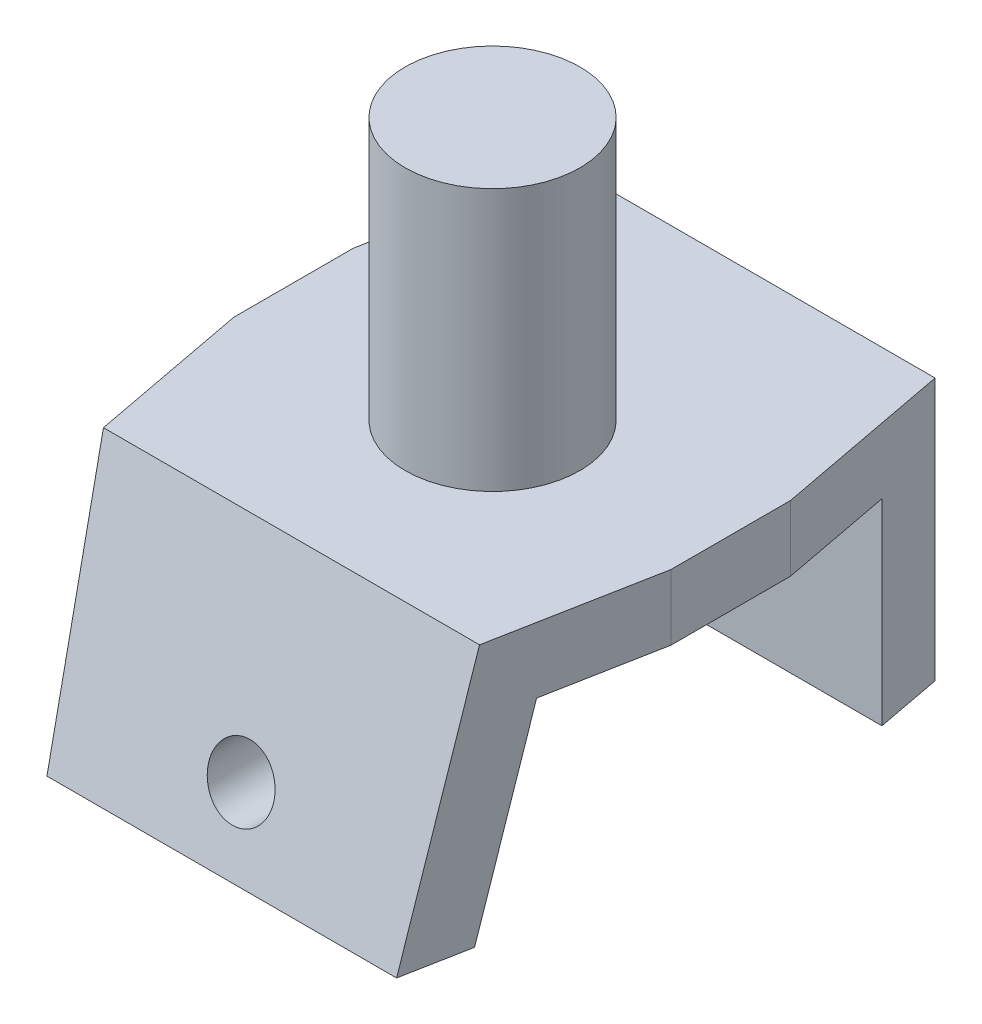
ISO-10303-21;
HEADER;
FILE_DESCRIPTION(('STEP AP214'),'2;1');
FILE_NAME('part.step','',(''),(''),'','','');
FILE_SCHEMA(('AUTOMOTIVE_DESIGN { 1 0 10303 214 1 1 1 1 }'));
ENDSEC;
DATA;
#1=APPLICATION_CONTEXT('core data for automotive mechanical design processes');
#2=APPLICATION_PROTOCOL_DEFINITION('international standard','automotive_design',2000,#1);
#3=PRODUCT_CONTEXT('',#1,'mechanical');
#4=PRODUCT('Part','Part','',(#3));
#5=PRODUCT_RELATED_PRODUCT_CATEGORY('part','',(#4));
#6=PRODUCT_DEFINITION_FORMATION('','',#4);
#7=PRODUCT_DEFINITION_CONTEXT('part definition',#1,'design');
#8=PRODUCT_DEFINITION('design','',#6,#7);
#9=PRODUCT_DEFINITION_SHAPE('','',#8);
#10=(LENGTH_UNIT() NAMED_UNIT(*) SI_UNIT(.MILLI.,.METRE.));
#11=(NAMED_UNIT(*) PLANE_ANGLE_UNIT() SI_UNIT($,.RADIAN.));
#12=(NAMED_UNIT(*) SI_UNIT($,.STERADIAN.) SOLID_ANGLE_UNIT());
#13=UNCERTAINTY_MEASURE_WITH_UNIT(LENGTH_MEASURE(1.E-05),#10,'distance_accuracy_value','');
#14=(GEOMETRIC_REPRESENTATION_CONTEXT(3) GLOBAL_UNCERTAINTY_ASSIGNED_CONTEXT((#13)) GLOBAL_UNIT_ASSIGNED_CONTEXT((#10,
#11,#12)) REPRESENTATION_CONTEXT('',''));
#15=CARTESIAN_POINT('',(0.,0.,0.));
#16=DIRECTION('',(0.,0.,1.));
#17=DIRECTION('',(1.,0.,0.));
#18=AXIS2_PLACEMENT_3D('',#15,#16,#17);
#19=CARTESIAN_POINT('',(100.,-28.7384488535837,51.4378814386497));
#20=DIRECTION('',(0.,1.,0.));
#21=DIRECTION('',(0.,0.,1.));
#22=AXIS2_PLACEMENT_3D('',#19,#20,#21);
#23=PLANE('',#22);
#24=DIRECTION('',(-1.,0.,0.));
#25=VECTOR('',#24,1.);
#26=CARTESIAN_POINT('',(100.,-28.7384488535837,51.4378814386497));
#27=LINE('',#26,#25);
#28=CARTESIAN_POINT('',(92.8433943169243,-28.7384488535837,51.4378814386497));
#29=VERTEX_POINT('',#28);
#30=CARTESIAN_POINT('',(7.15660568307573,-28.7384488535837,51.4378814386497));
#31=VERTEX_POINT('',#30);
#32=EDGE_CURVE('E181',#29,#31,#27,.T.);
#33=ORIENTED_EDGE('',*,*,#32,.F.);
#34=DIRECTION('',(-0.186243030394392,0.,0.982503706674694));
#35=VECTOR('',#34,1.);
#36=CARTESIAN_POINT('',(93.0916316792771,-28.7384488535837,50.1283337571588));
#37=LINE('',#36,#35);
#38=CARTESIAN_POINT('',(90.,-28.7384488535835,66.4378814386497));
#39=VERTEX_POINT('',#38);
#40=EDGE_CURVE('E206',#29,#39,#37,.T.);
#41=ORIENTED_EDGE('',*,*,#40,.T.);
#42=DIRECTION('',(-1.,0.,0.));
#43=VECTOR('',#42,1.);
#44=CARTESIAN_POINT('',(100.,-28.7384488535837,66.4378814386497));
#45=LINE('',#44,#43);
#46=CARTESIAN_POINT('',(10.,-28.7384488535835,66.4378814386497));
#47=VERTEX_POINT('',#46);
#48=EDGE_CURVE('E162',#39,#47,#45,.T.);
#49=ORIENTED_EDGE('',*,*,#48,.T.);
#50=DIRECTION('',(-0.186243030394392,0.,-0.982503706674694));
#51=VECTOR('',#50,1.);
#52=CARTESIAN_POINT('',(10.3770149577715,-28.7384488535837,68.4267805276406));
#53=LINE('',#52,#51);
#54=EDGE_CURVE('E251',#47,#31,#53,.T.);
#55=ORIENTED_EDGE('',*,*,#54,.T.);
#56=EDGE_LOOP('',(#33,#41,#49,#55));
#57=FACE_BOUND('',#56,.T.);
#58=ADVANCED_FACE('F37',(#57),#23,.F.);
#59=CARTESIAN_POINT('',(100.,-28.7384488535837,51.4378814386497));
#60=DIRECTION('',(0.,0.258819045102518,0.965925826289069));
#61=DIRECTION('',(0.,-0.965925826289069,0.258819045102518));
#62=AXIS2_PLACEMENT_3D('',#59,#60,#61);
#63=PLANE('',#62);
#64=CARTESIAN_POINT('',(50.,-12.1856687898089,47.0025773880713));
#65=DIRECTION('',(0.,0.258819045102518,0.965925826289069));
#66=DIRECTION('',(0.,0.965925826289069,-0.258819045102518));
#67=AXIS2_PLACEMENT_3D('',#64,#65,#66);
#68=ELLIPSE('',#67,7.76457135307562,7.5);
#69=CARTESIAN_POINT('',(50.,-4.6856687898089,44.992958444838));
#70=VERTEX_POINT('',#69);
#71=EDGE_CURVE('E158',#70,#70,#68,.T.);
#72=ORIENTED_EDGE('',*,*,#71,.T.);
#73=EDGE_LOOP('',(#72));
#74=FACE_BOUND('',#73,.T.);
#75=DIRECTION('',(-1.,0.,0.));
#76=VECTOR('',#75,1.);
#77=CARTESIAN_POINT('',(100.,15.8143312101911,39.5));
#78=LINE('',#77,#76);
#79=CARTESIAN_POINT('',(95.1063345995091,15.8143312101911,39.5));
#80=VERTEX_POINT('',#79);
#81=CARTESIAN_POINT('',(4.8936654004909,15.8143312101911,39.5));
#82=VERTEX_POINT('',#81);
#83=EDGE_CURVE('E178',#80,#82,#78,.T.);
#84=ORIENTED_EDGE('',*,*,#83,.F.);
#85=DIRECTION('',(-0.0490026997369039,-0.964765407514735,0.258508111829053));
#86=VECTOR('',#85,1.);
#87=CARTESIAN_POINT('',(92.8605792206749,-28.4001123790826,51.3472244535372));
#88=LINE('',#87,#86);
#89=EDGE_CURVE('E214',#80,#29,#88,.T.);
#90=ORIENTED_EDGE('',*,*,#89,.T.);
#91=ORIENTED_EDGE('',*,*,#32,.T.);
#92=DIRECTION('',(-0.0490026997369039,0.964765407514735,-0.258508111829053));
#93=VECTOR('',#92,1.);
#94=CARTESIAN_POINT('',(7.37954723747569,-33.1277233371822,52.6139839918885));
#95=LINE('',#94,#93);
#96=EDGE_CURVE('E253',#31,#82,#95,.T.);
#97=ORIENTED_EDGE('',*,*,#96,.T.);
#98=EDGE_LOOP('',(#84,#90,#91,#97));
#99=FACE_BOUND('',#98,.T.);
#100=ADVANCED_FACE('F225',(#74,#99),#63,.F.);
#101=CARTESIAN_POINT('',(100.,15.8143312101911,39.5));
#102=DIRECTION('',(0.,1.,0.));
#103=DIRECTION('',(0.,0.,1.));
#104=AXIS2_PLACEMENT_3D('',#101,#102,#103);
#105=PLANE('',#104);
#106=DIRECTION('',(0.,0.,-1.));
#107=VECTOR('',#106,1.);
#108=CARTESIAN_POINT('',(100.,15.8143312101911,39.5));
#109=LINE('',#108,#107);
#110=CARTESIAN_POINT('',(100.,15.8143312101911,13.6840304841132));
#111=VERTEX_POINT('',#110);
#112=CARTESIAN_POINT('',(100.,15.8143312101911,-13.6840304841132));
#113=VERTEX_POINT('',#112);
#114=EDGE_CURVE('E152',#111,#113,#109,.T.);
#115=ORIENTED_EDGE('',*,*,#114,.F.);
#116=DIRECTION('',(-0.186243030394392,0.,0.982503706674694));
#117=VECTOR('',#116,1.);
#118=CARTESIAN_POINT('',(95.2760785598517,15.8143312101911,38.6045352415657));
#119=LINE('',#118,#117);
#120=EDGE_CURVE('E60',#111,#80,#119,.T.);
#121=ORIENTED_EDGE('',*,*,#120,.T.);
#122=ORIENTED_EDGE('',*,*,#83,.T.);
#123=DIRECTION('',(-0.186243030394392,0.,-0.982503706674694));
#124=VECTOR('',#123,1.);
#125=CARTESIAN_POINT('',(8.192568077197,15.8143312101911,56.9029820120475));
#126=LINE('',#125,#124);
#127=CARTESIAN_POINT('',(0.,15.8143312101911,13.6840304841132));
#128=VERTEX_POINT('',#127);
#129=EDGE_CURVE('E268',#82,#128,#126,.T.);
#130=ORIENTED_EDGE('',*,*,#129,.T.);
#131=DIRECTION('',(0.,0.,-1.));
#132=VECTOR('',#131,1.);
#133=CARTESIAN_POINT('',(0.,15.8143312101911,39.5));
#134=LINE('',#133,#132);
#135=CARTESIAN_POINT('',(0.,15.8143312101911,-13.6840304841132));
#136=VERTEX_POINT('',#135);
#137=EDGE_CURVE('E153',#128,#136,#134,.T.);
#138=ORIENTED_EDGE('',*,*,#137,.T.);
#139=DIRECTION('',(0.186243030394392,0.,-0.982503706674694));
#140=VECTOR('',#139,1.);
#141=CARTESIAN_POINT('',(-6.2632048714836,15.8143312101911,19.3567871446841));
#142=LINE('',#141,#140);
#143=CARTESIAN_POINT('',(4.8936654004909,15.8143312101911,-39.5));
#144=VERTEX_POINT('',#143);
#145=EDGE_CURVE('E131',#136,#144,#142,.T.);
#146=ORIENTED_EDGE('',*,*,#145,.T.);
#147=DIRECTION('',(-1.,0.,0.));
#148=VECTOR('',#147,1.);
#149=CARTESIAN_POINT('',(100.,15.8143312101911,-39.5));
#150=LINE('',#149,#148);
#151=CARTESIAN_POINT('',(95.1063345995091,15.8143312101911,-39.5));
#152=VERTEX_POINT('',#151);
#153=EDGE_CURVE('E175',#152,#144,#150,.T.);
#154=ORIENTED_EDGE('',*,*,#153,.F.);
#155=DIRECTION('',(0.186243030394392,0.,0.982503706674694));
#156=VECTOR('',#155,1.);
#157=CARTESIAN_POINT('',(109.731851508532,15.8143312101911,37.6552339151659));
#158=LINE('',#157,#156);
#159=EDGE_CURVE('E200',#152,#113,#158,.T.);
#160=ORIENTED_EDGE('',*,*,#159,.T.);
#161=EDGE_LOOP('',(#115,#121,#122,#130,#138,#146,#154,#160));
#162=FACE_BOUND('',#161,.T.);
#163=ADVANCED_FACE('F197',(#162),#105,.F.);
#164=CARTESIAN_POINT('',(100.,15.8143312101911,-39.5));
#165=DIRECTION('',(0.,0.,-1.));
#166=DIRECTION('',(0.,1.,0.));
#167=AXIS2_PLACEMENT_3D('',#164,#165,#166);
#168=PLANE('',#167);
#169=CARTESIAN_POINT('',(50.,-12.1856687898089,-39.5));
#170=DIRECTION('',(0.,0.,-1.));
#171=DIRECTION('',(0.,1.,0.));
#172=AXIS2_PLACEMENT_3D('',#169,#170,#171);
#173=CIRCLE('',#172,7.5);
#174=CARTESIAN_POINT('',(50.,-4.68566878980889,-39.5));
#175=VERTEX_POINT('',#174);
#176=EDGE_CURVE('E187',#175,#175,#173,.T.);
#177=ORIENTED_EDGE('',*,*,#176,.T.);
#178=EDGE_LOOP('',(#177));
#179=FACE_BOUND('',#178,.T.);
#180=DIRECTION('',(-1.,0.,0.));
#181=VECTOR('',#180,1.);
#182=CARTESIAN_POINT('',(100.,-29.1856687898089,-39.5));
#183=LINE('',#182,#181);
#184=CARTESIAN_POINT('',(95.1063345995091,-29.1856687898089,-39.5));
#185=VERTEX_POINT('',#184);
#186=CARTESIAN_POINT('',(4.89366540049089,-29.1856687898089,-39.5));
#187=VERTEX_POINT('',#186);
#188=EDGE_CURVE('E172',#185,#187,#183,.T.);
#189=ORIENTED_EDGE('',*,*,#188,.F.);
#190=DIRECTION('',(0.,1.,0.));
#191=VECTOR('',#190,1.);
#192=CARTESIAN_POINT('',(95.1063345995091,15.8143312101911,-39.5));
#193=LINE('',#192,#191);
#194=EDGE_CURVE('E203',#185,#152,#193,.T.);
#195=ORIENTED_EDGE('',*,*,#194,.T.);
#196=ORIENTED_EDGE('',*,*,#153,.T.);
#197=DIRECTION('',(0.,-1.,0.));
#198=VECTOR('',#197,1.);
#199=CARTESIAN_POINT('',(4.8936654004909,15.8143312101911,-39.5));
#200=LINE('',#199,#198);
#201=EDGE_CURVE('E276',#144,#187,#200,.T.);
#202=ORIENTED_EDGE('',*,*,#201,.T.);
#203=EDGE_LOOP('',(#189,#195,#196,#202));
#204=FACE_BOUND('',#203,.T.);
#205=ADVANCED_FACE('F288',(#179,#204),#168,.F.);
#206=CARTESIAN_POINT('',(100.,-29.1856687898089,-39.5));
#207=DIRECTION('',(0.,1.,0.));
#208=DIRECTION('',(0.,0.,1.));
#209=AXIS2_PLACEMENT_3D('',#206,#207,#208);
#210=PLANE('',#209);
#211=DIRECTION('',(-1.,0.,0.));
#212=VECTOR('',#211,1.);
#213=CARTESIAN_POINT('',(100.,-29.1856687898089,-54.5));
#214=LINE('',#213,#212);
#215=CARTESIAN_POINT('',(92.2629402825848,-29.1856687898089,-54.5));
#216=VERTEX_POINT('',#215);
#217=CARTESIAN_POINT('',(7.73705971741517,-29.1856687898089,-54.5));
#218=VERTEX_POINT('',#217);
#219=EDGE_CURVE('E169',#216,#218,#214,.T.);
#220=ORIENTED_EDGE('',*,*,#219,.F.);
#221=DIRECTION('',(0.186243030394392,0.,0.982503706674694));
#222=VECTOR('',#221,1.);
#223=CARTESIAN_POINT('',(95.2760785598517,-29.1856687898089,-38.6045352415657));
#224=LINE('',#223,#222);
#225=EDGE_CURVE('E208',#216,#185,#224,.T.);
#226=ORIENTED_EDGE('',*,*,#225,.T.);
#227=ORIENTED_EDGE('',*,*,#188,.T.);
#228=DIRECTION('',(0.186243030394392,0.,-0.982503706674694));
#229=VECTOR('',#228,1.);
#230=CARTESIAN_POINT('',(8.19256807719698,-29.1856687898089,-56.9029820120475));
#231=LINE('',#230,#229);
#232=EDGE_CURVE('E273',#187,#218,#231,.T.);
#233=ORIENTED_EDGE('',*,*,#232,.T.);
#234=EDGE_LOOP('',(#220,#226,#227,#233));
#235=FACE_BOUND('',#234,.T.);
#236=ADVANCED_FACE('F286',(#235),#210,.F.);
#237=CARTESIAN_POINT('',(100.,-29.1856687898089,-54.5));
#238=DIRECTION('',(0.,0.,1.));
#239=DIRECTION('',(1.,0.,0.));
#240=AXIS2_PLACEMENT_3D('',#237,#238,#239);
#241=PLANE('',#240);
#242=CARTESIAN_POINT('',(50.,-12.1856687898089,-54.5));
#243=DIRECTION('',(0.,0.,-1.));
#244=DIRECTION('',(0.,1.,0.));
#245=AXIS2_PLACEMENT_3D('',#242,#243,#244);
#246=CIRCLE('',#245,7.5);
#247=CARTESIAN_POINT('',(50.,-4.68566878980889,-54.5));
#248=VERTEX_POINT('',#247);
#249=EDGE_CURVE('E188',#248,#248,#246,.T.);
#250=ORIENTED_EDGE('',*,*,#249,.F.);
#251=EDGE_LOOP('',(#250));
#252=FACE_BOUND('',#251,.T.);
#253=DIRECTION('',(-1.,0.,0.));
#254=VECTOR('',#253,1.);
#255=CARTESIAN_POINT('',(100.,30.8143312101911,-54.5));
#256=LINE('',#255,#254);
#257=CARTESIAN_POINT('',(92.2629402825848,30.8143312101911,-54.5));
#258=VERTEX_POINT('',#257);
#259=CARTESIAN_POINT('',(7.73705971741518,30.8143312101911,-54.5));
#260=VERTEX_POINT('',#259);
#261=EDGE_CURVE('E147',#258,#260,#256,.T.);
#262=ORIENTED_EDGE('',*,*,#261,.F.);
#263=DIRECTION('',(0.,-1.,0.));
#264=VECTOR('',#263,1.);
#265=CARTESIAN_POINT('',(92.2629402825848,-29.1856687898089,-54.5));
#266=LINE('',#265,#264);
#267=EDGE_CURVE('E280',#258,#216,#266,.T.);
#268=ORIENTED_EDGE('',*,*,#267,.T.);
#269=ORIENTED_EDGE('',*,*,#219,.T.);
#270=DIRECTION('',(0.,1.,0.));
#271=VECTOR('',#270,1.);
#272=CARTESIAN_POINT('',(7.73705971741517,-29.1856687898089,-54.5));
#273=LINE('',#272,#271);
#274=EDGE_CURVE('E271',#218,#260,#273,.T.);
#275=ORIENTED_EDGE('',*,*,#274,.T.);
#276=EDGE_LOOP('',(#262,#268,#269,#275));
#277=FACE_BOUND('',#276,.T.);
#278=ADVANCED_FACE('F317',(#252,#277),#241,.F.);
#279=CARTESIAN_POINT('',(100.,30.8143312101911,-54.5));
#280=DIRECTION('',(0.,-1.,0.));
#281=DIRECTION('',(0.,0.,-1.));
#282=AXIS2_PLACEMENT_3D('',#279,#280,#281);
#283=PLANE('',#282);
#284=CARTESIAN_POINT('',(50.,30.8143312101911,4.4807621135332));
#285=DIRECTION('',(0.,1.,0.));
#286=DIRECTION('',(0.,0.,1.));
#287=AXIS2_PLACEMENT_3D('',#284,#285,#286);
#288=CIRCLE('',#287,20.);
#289=CARTESIAN_POINT('',(50.,30.8143312101911,24.4807621135332));
#290=VERTEX_POINT('',#289);
#291=EDGE_CURVE('E11',#290,#290,#288,.T.);
#292=ORIENTED_EDGE('',*,*,#291,.F.);
#293=EDGE_LOOP('',(#292));
#294=FACE_BOUND('',#293,.T.);
#295=DIRECTION('',(-1.,0.,0.));
#296=VECTOR('',#295,1.);
#297=CARTESIAN_POINT('',(100.,30.8143312101911,50.4807621135332));
#298=LINE('',#297,#296);
#299=CARTESIAN_POINT('',(93.0248254935679,30.8143312101911,50.4807621135332));
#300=VERTEX_POINT('',#299);
#301=CARTESIAN_POINT('',(6.97517450643208,30.8143312101911,50.4807621135332));
#302=VERTEX_POINT('',#301);
#303=EDGE_CURVE('E165',#300,#302,#298,.T.);
#304=ORIENTED_EDGE('',*,*,#303,.F.);
#305=DIRECTION('',(-0.186243030394392,0.,0.982503706674694));
#306=VECTOR('',#305,1.);
#307=CARTESIAN_POINT('',(90.,30.8143312101911,66.4378814386497));
#308=LINE('',#307,#306);
#309=CARTESIAN_POINT('',(100.,30.8143312101911,13.6840304841132));
#310=VERTEX_POINT('',#309);
#311=EDGE_CURVE('E255',#310,#300,#308,.T.);
#312=ORIENTED_EDGE('',*,*,#311,.F.);
#313=DIRECTION('',(0.,0.,1.));
#314=VECTOR('',#313,1.);
#315=CARTESIAN_POINT('',(100.,30.8143312101911,-54.5));
#316=LINE('',#315,#314);
#317=CARTESIAN_POINT('',(100.,30.8143312101911,-13.6840304841132));
#318=VERTEX_POINT('',#317);
#319=EDGE_CURVE('E156',#318,#310,#316,.T.);
#320=ORIENTED_EDGE('',*,*,#319,.F.);
#321=DIRECTION('',(0.186243030394392,0.,0.982503706674694));
#322=VECTOR('',#321,1.);
#323=CARTESIAN_POINT('',(90.,30.8143312101911,-66.4378814386497));
#324=LINE('',#323,#322);
#325=EDGE_CURVE('E52',#258,#318,#324,.T.);
#326=ORIENTED_EDGE('',*,*,#325,.F.);
#327=ORIENTED_EDGE('',*,*,#261,.T.);
#328=DIRECTION('',(0.186243030394392,0.,-0.982503706674694));
#329=VECTOR('',#328,1.);
#330=CARTESIAN_POINT('',(10.,30.8143312101911,-66.4378814386497));
#331=LINE('',#330,#329);
#332=CARTESIAN_POINT('',(0.,30.8143312101911,-13.6840304841132));
#333=VERTEX_POINT('',#332);
#334=EDGE_CURVE('E128',#333,#260,#331,.T.);
#335=ORIENTED_EDGE('',*,*,#334,.F.);
#336=DIRECTION('',(0.,0.,1.));
#337=VECTOR('',#336,1.);
#338=CARTESIAN_POINT('',(0.,30.8143312101911,-54.5));
#339=LINE('',#338,#337);
#340=CARTESIAN_POINT('',(0.,30.8143312101911,13.6840304841132));
#341=VERTEX_POINT('',#340);
#342=EDGE_CURVE('E145',#333,#341,#339,.T.);
#343=ORIENTED_EDGE('',*,*,#342,.T.);
#344=DIRECTION('',(-0.186243030394392,0.,-0.982503706674694));
#345=VECTOR('',#344,1.);
#346=CARTESIAN_POINT('',(10.,30.8143312101911,66.4378814386497));
#347=LINE('',#346,#345);
#348=EDGE_CURVE('E148',#302,#341,#347,.T.);
#349=ORIENTED_EDGE('',*,*,#348,.F.);
#350=EDGE_LOOP('',(#304,#312,#320,#326,#327,#335,#343,#349));
#351=FACE_BOUND('',#350,.T.);
#352=ADVANCED_FACE('F143',(#294,#351),#283,.F.);
#353=CARTESIAN_POINT('',(100.,-28.7384488535837,66.4378814386497));
#354=DIRECTION('',(0.,-0.258819045102518,-0.965925826289069));
#355=DIRECTION('',(0.,0.965925826289069,-0.258819045102518));
#356=AXIS2_PLACEMENT_3D('',#353,#354,#355);
#357=PLANE('',#356);
#358=CARTESIAN_POINT('',(50.,-12.1856687898089,62.0025773880713));
#359=DIRECTION('',(0.,-0.258819045102518,-0.965925826289069));
#360=DIRECTION('',(0.,0.965925826289069,-0.258819045102518));
#361=AXIS2_PLACEMENT_3D('',#358,#359,#360);
#362=ELLIPSE('',#361,7.76457135307562,7.5);
#363=CARTESIAN_POINT('',(50.,-4.68566878980891,59.9929584448379));
#364=VERTEX_POINT('',#363);
#365=EDGE_CURVE('E184',#364,#364,#362,.T.);
#366=ORIENTED_EDGE('',*,*,#365,.T.);
#367=EDGE_LOOP('',(#366));
#368=FACE_BOUND('',#367,.T.);
#369=ORIENTED_EDGE('',*,*,#48,.F.);
#370=DIRECTION('',(0.049002699736904,0.964765407514735,-0.258508111829053));
#371=VECTOR('',#370,1.);
#372=CARTESIAN_POINT('',(90.024012645815,-28.2656877577737,66.3112054848146));
#373=LINE('',#372,#371);
#374=EDGE_CURVE('E202',#39,#300,#373,.T.);
#375=ORIENTED_EDGE('',*,*,#374,.T.);
#376=ORIENTED_EDGE('',*,*,#303,.T.);
#377=DIRECTION('',(0.049002699736904,-0.964765407514735,0.258508111829053));
#378=VECTOR('',#377,1.);
#379=CARTESIAN_POINT('',(10.2161138123355,-32.9932987158733,67.5779650231659));
#380=LINE('',#379,#378);
#381=EDGE_CURVE('E260',#302,#47,#380,.T.);
#382=ORIENTED_EDGE('',*,*,#381,.T.);
#383=EDGE_LOOP('',(#369,#375,#376,#382));
#384=FACE_BOUND('',#383,.T.);
#385=ADVANCED_FACE('F257',(#368,#384),#357,.F.);
#386=CARTESIAN_POINT('',(100.,0.,0.));
#387=DIRECTION('',(-1.,0.,0.));
#388=DIRECTION('',(0.,0.,1.));
#389=AXIS2_PLACEMENT_3D('',#386,#387,#388);
#390=PLANE('',#389);
#391=ORIENTED_EDGE('',*,*,#319,.T.);
#392=DIRECTION('',(0.,-1.,0.));
#393=VECTOR('',#392,1.);
#394=CARTESIAN_POINT('',(100.,0.,13.6840304841132));
#395=LINE('',#394,#393);
#396=EDGE_CURVE('E40',#310,#111,#395,.T.);
#397=ORIENTED_EDGE('',*,*,#396,.T.);
#398=ORIENTED_EDGE('',*,*,#114,.T.);
#399=DIRECTION('',(0.,1.,0.));
#400=VECTOR('',#399,1.);
#401=CARTESIAN_POINT('',(100.,0.,-13.6840304841133));
#402=LINE('',#401,#400);
#403=EDGE_CURVE('E136',#113,#318,#402,.T.);
#404=ORIENTED_EDGE('',*,*,#403,.T.);
#405=EDGE_LOOP('',(#391,#397,#398,#404));
#406=FACE_BOUND('',#405,.T.);
#407=ADVANCED_FACE('F193',(#406),#390,.F.);
#408=CARTESIAN_POINT('',(0.,0.,0.));
#409=DIRECTION('',(-1.,0.,0.));
#410=DIRECTION('',(0.,0.,1.));
#411=AXIS2_PLACEMENT_3D('',#408,#409,#410);
#412=PLANE('',#411);
#413=DIRECTION('',(0.,1.,0.));
#414=VECTOR('',#413,1.);
#415=CARTESIAN_POINT('',(0.,0.,-13.6840304841132));
#416=LINE('',#415,#414);
#417=EDGE_CURVE('E125',#136,#333,#416,.T.);
#418=ORIENTED_EDGE('',*,*,#417,.F.);
#419=ORIENTED_EDGE('',*,*,#137,.F.);
#420=DIRECTION('',(0.,-1.,0.));
#421=VECTOR('',#420,1.);
#422=CARTESIAN_POINT('',(0.,0.,13.6840304841132));
#423=LINE('',#422,#421);
#424=EDGE_CURVE('E137',#341,#128,#423,.T.);
#425=ORIENTED_EDGE('',*,*,#424,.F.);
#426=ORIENTED_EDGE('',*,*,#342,.F.);
#427=EDGE_LOOP('',(#418,#419,#425,#426));
#428=FACE_BOUND('',#427,.T.);
#429=ADVANCED_FACE('F151',(#428),#412,.T.);
#430=CARTESIAN_POINT('',(50.,-12.1856687898089,65.5));
#431=DIRECTION('',(0.,0.,-1.));
#432=DIRECTION('',(0.,1.,0.));
#433=AXIS2_PLACEMENT_3D('',#430,#431,#432);
#434=CYLINDRICAL_SURFACE('',#433,7.5);
#435=ORIENTED_EDGE('',*,*,#365,.F.);
#436=EDGE_LOOP('',(#435));
#437=FACE_BOUND('',#436,.T.);
#438=ORIENTED_EDGE('',*,*,#71,.F.);
#439=EDGE_LOOP('',(#438));
#440=FACE_BOUND('',#439,.T.);
#441=ADVANCED_FACE('F228',(#437,#440),#434,.F.);
#442=ORIENTED_EDGE('',*,*,#249,.T.);
#443=EDGE_LOOP('',(#442));
#444=FACE_BOUND('',#443,.T.);
#445=ORIENTED_EDGE('',*,*,#176,.F.);
#446=EDGE_LOOP('',(#445));
#447=FACE_BOUND('',#446,.T.);
#448=ADVANCED_FACE('F230',(#444,#447),#434,.F.);
#449=CARTESIAN_POINT('',(10.,-69.1856687898089,66.4378814386497));
#450=DIRECTION('',(0.982503706674694,0.,-0.186243030394392));
#451=DIRECTION('',(-0.186243030394392,0.,-0.982503706674694));
#452=AXIS2_PLACEMENT_3D('',#449,#450,#451);
#453=PLANE('',#452);
#454=ORIENTED_EDGE('',*,*,#96,.F.);
#455=ORIENTED_EDGE('',*,*,#54,.F.);
#456=ORIENTED_EDGE('',*,*,#381,.F.);
#457=ORIENTED_EDGE('',*,*,#348,.T.);
#458=ORIENTED_EDGE('',*,*,#424,.T.);
#459=ORIENTED_EDGE('',*,*,#129,.F.);
#460=EDGE_LOOP('',(#454,#455,#456,#457,#458,#459));
#461=FACE_BOUND('',#460,.T.);
#462=ADVANCED_FACE('F237',(#461),#453,.F.);
#463=CARTESIAN_POINT('',(10.,-69.1856687898089,-66.4378814386497));
#464=DIRECTION('',(0.982503706674694,0.,0.186243030394392));
#465=DIRECTION('',(0.186243030394392,0.,-0.982503706674694));
#466=AXIS2_PLACEMENT_3D('',#463,#464,#465);
#467=PLANE('',#466);
#468=ORIENTED_EDGE('',*,*,#417,.T.);
#469=ORIENTED_EDGE('',*,*,#334,.T.);
#470=ORIENTED_EDGE('',*,*,#274,.F.);
#471=ORIENTED_EDGE('',*,*,#232,.F.);
#472=ORIENTED_EDGE('',*,*,#201,.F.);
#473=ORIENTED_EDGE('',*,*,#145,.F.);
#474=EDGE_LOOP('',(#468,#469,#470,#471,#472,#473));
#475=FACE_BOUND('',#474,.T.);
#476=ADVANCED_FACE('F127',(#475),#467,.F.);
#477=CARTESIAN_POINT('',(90.,-69.1856687898089,-66.4378814386497));
#478=DIRECTION('',(-0.982503706674694,0.,0.186243030394392));
#479=DIRECTION('',(0.186243030394392,0.,0.982503706674694));
#480=AXIS2_PLACEMENT_3D('',#477,#478,#479);
#481=PLANE('',#480);
#482=ORIENTED_EDGE('',*,*,#194,.F.);
#483=ORIENTED_EDGE('',*,*,#225,.F.);
#484=ORIENTED_EDGE('',*,*,#267,.F.);
#485=ORIENTED_EDGE('',*,*,#325,.T.);
#486=ORIENTED_EDGE('',*,*,#403,.F.);
#487=ORIENTED_EDGE('',*,*,#159,.F.);
#488=EDGE_LOOP('',(#482,#483,#484,#485,#486,#487));
#489=FACE_BOUND('',#488,.T.);
#490=ADVANCED_FACE('F293',(#489),#481,.F.);
#491=CARTESIAN_POINT('',(90.,-69.1856687898089,66.4378814386497));
#492=DIRECTION('',(-0.982503706674694,0.,-0.186243030394392));
#493=DIRECTION('',(-0.186243030394392,0.,0.982503706674694));
#494=AXIS2_PLACEMENT_3D('',#491,#492,#493);
#495=PLANE('',#494);
#496=ORIENTED_EDGE('',*,*,#396,.F.);
#497=ORIENTED_EDGE('',*,*,#311,.T.);
#498=ORIENTED_EDGE('',*,*,#374,.F.);
#499=ORIENTED_EDGE('',*,*,#40,.F.);
#500=ORIENTED_EDGE('',*,*,#89,.F.);
#501=ORIENTED_EDGE('',*,*,#120,.F.);
#502=EDGE_LOOP('',(#496,#497,#498,#499,#500,#501));
#503=FACE_BOUND('',#502,.T.);
#504=ADVANCED_FACE('F254',(#503),#495,.F.);
#505=CARTESIAN_POINT('',(50.,90.8143312101911,4.48076211353321));
#506=DIRECTION('',(0.,-1.,0.));
#507=DIRECTION('',(0.,0.,-1.));
#508=AXIS2_PLACEMENT_3D('',#505,#506,#507);
#509=CYLINDRICAL_SURFACE('',#508,20.);
#510=CARTESIAN_POINT('',(50.,90.8143312101911,4.48076211353321));
#511=DIRECTION('',(0.,1.,0.));
#512=DIRECTION('',(0.,0.,1.));
#513=AXIS2_PLACEMENT_3D('',#510,#511,#512);
#514=CIRCLE('',#513,20.);
#515=CARTESIAN_POINT('',(50.,90.8143312101911,24.4807621135332));
#516=VERTEX_POINT('',#515);
#517=EDGE_CURVE('E311',#516,#516,#514,.T.);
#518=ORIENTED_EDGE('',*,*,#517,.F.);
#519=EDGE_LOOP('',(#518));
#520=FACE_BOUND('',#519,.T.);
#521=ORIENTED_EDGE('',*,*,#291,.T.);
#522=EDGE_LOOP('',(#521));
#523=FACE_BOUND('',#522,.T.);
#524=ADVANCED_FACE('F298',(#520,#523),#509,.T.);
#525=CARTESIAN_POINT('',(50.,90.8143312101911,4.48076211353321));
#526=DIRECTION('',(0.,1.,0.));
#527=DIRECTION('',(0.,0.,1.));
#528=AXIS2_PLACEMENT_3D('',#525,#526,#527);
#529=PLANE('',#528);
#530=ORIENTED_EDGE('',*,*,#517,.T.);
#531=EDGE_LOOP('',(#530));
#532=FACE_BOUND('',#531,.T.);
#533=ADVANCED_FACE('F303',(#532),#529,.T.);
#534=CLOSED_SHELL('',(#58,#100,#163,#205,#236,#278,#352,#385,#407,#429,#441,#448,#462,#476,#490,
#504,#524,#533));
#535=MANIFOLD_SOLID_BREP('B2',#534);
#536=ADVANCED_BREP_SHAPE_REPRESENTATION('',(#18,#535),#14);
#537=SHAPE_DEFINITION_REPRESENTATION(#9,#536);
ENDSEC;
END-ISO-10303-21;
